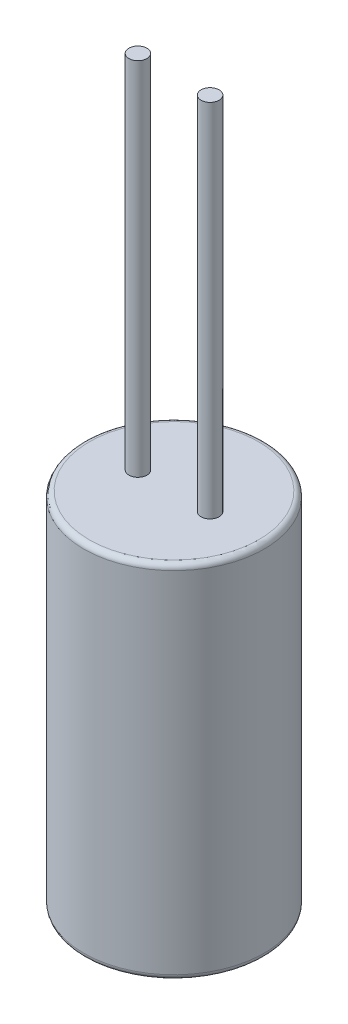
ISO-10303-21;
HEADER;
FILE_DESCRIPTION(('STEP AP214'),'2;1');
FILE_NAME('part.step','',(''),(''),'','','');
FILE_SCHEMA(('AUTOMOTIVE_DESIGN { 1 0 10303 214 1 1 1 1 }'));
ENDSEC;
DATA;
#1=APPLICATION_CONTEXT('core data for automotive mechanical design processes');
#2=APPLICATION_PROTOCOL_DEFINITION('international standard','automotive_design',2000,#1);
#3=PRODUCT_CONTEXT('',#1,'mechanical');
#4=PRODUCT('Part','Part','',(#3));
#5=PRODUCT_RELATED_PRODUCT_CATEGORY('part','',(#4));
#6=PRODUCT_DEFINITION_FORMATION('','',#4);
#7=PRODUCT_DEFINITION_CONTEXT('part definition',#1,'design');
#8=PRODUCT_DEFINITION('design','',#6,#7);
#9=PRODUCT_DEFINITION_SHAPE('','',#8);
#10=(LENGTH_UNIT() NAMED_UNIT(*) SI_UNIT(.MILLI.,.METRE.));
#11=(NAMED_UNIT(*) PLANE_ANGLE_UNIT() SI_UNIT($,.RADIAN.));
#12=(NAMED_UNIT(*) SI_UNIT($,.STERADIAN.) SOLID_ANGLE_UNIT());
#13=UNCERTAINTY_MEASURE_WITH_UNIT(LENGTH_MEASURE(1.E-05),#10,'distance_accuracy_value','');
#14=(GEOMETRIC_REPRESENTATION_CONTEXT(3) GLOBAL_UNCERTAINTY_ASSIGNED_CONTEXT((#13)) GLOBAL_UNIT_ASSIGNED_CONTEXT((#10,
#11,#12)) REPRESENTATION_CONTEXT('',''));
#15=CARTESIAN_POINT('',(0.,0.,0.));
#16=DIRECTION('',(0.,0.,1.));
#17=DIRECTION('',(1.,0.,0.));
#18=AXIS2_PLACEMENT_3D('',#15,#16,#17);
#19=CARTESIAN_POINT('',(0.,20.,0.));
#20=DIRECTION('',(0.,-1.,0.));
#21=DIRECTION('',(0.,0.,-1.));
#22=AXIS2_PLACEMENT_3D('',#19,#20,#21);
#23=CYLINDRICAL_SURFACE('',#22,5.);
#24=CARTESIAN_POINT('',(0.,0.300000000000002,0.));
#25=DIRECTION('',(0.,1.,0.));
#26=DIRECTION('',(0.,0.,1.));
#27=AXIS2_PLACEMENT_3D('',#24,#25,#26);
#28=CIRCLE('',#27,5.);
#29=CARTESIAN_POINT('',(0.,0.300000000000002,5.));
#30=VERTEX_POINT('',#29);
#31=EDGE_CURVE('E44',#30,#30,#28,.T.);
#32=ORIENTED_EDGE('',*,*,#31,.T.);
#33=EDGE_LOOP('',(#32));
#34=FACE_BOUND('',#33,.T.);
#35=CARTESIAN_POINT('',(0.,19.7,0.));
#36=DIRECTION('',(0.,1.,0.));
#37=DIRECTION('',(0.,0.,1.));
#38=AXIS2_PLACEMENT_3D('',#35,#36,#37);
#39=CIRCLE('',#38,5.);
#40=CARTESIAN_POINT('',(0.,19.7,5.));
#41=VERTEX_POINT('',#40);
#42=EDGE_CURVE('E48',#41,#41,#39,.F.);
#43=ORIENTED_EDGE('',*,*,#42,.T.);
#44=EDGE_LOOP('',(#43));
#45=FACE_BOUND('',#44,.T.);
#46=ADVANCED_FACE('F33',(#34,#45),#23,.T.);
#47=CARTESIAN_POINT('',(0.,20.,0.));
#48=DIRECTION('',(0.,1.,0.));
#49=DIRECTION('',(0.,0.,1.));
#50=AXIS2_PLACEMENT_3D('',#47,#48,#49);
#51=PLANE('',#50);
#52=CARTESIAN_POINT('',(0.,20.,0.));
#53=DIRECTION('',(0.,1.,0.));
#54=DIRECTION('',(0.,0.,1.));
#55=AXIS2_PLACEMENT_3D('',#52,#53,#54);
#56=CIRCLE('',#55,4.7);
#57=CARTESIAN_POINT('',(0.,20.,4.7));
#58=VERTEX_POINT('',#57);
#59=EDGE_CURVE('E10',#58,#58,#56,.T.);
#60=ORIENTED_EDGE('',*,*,#59,.T.);
#61=EDGE_LOOP('',(#60));
#62=FACE_BOUND('',#61,.T.);
#63=CARTESIAN_POINT('',(2.,20.,0.));
#64=DIRECTION('',(0.,1.,0.));
#65=DIRECTION('',(0.,0.,1.));
#66=AXIS2_PLACEMENT_3D('',#63,#64,#65);
#67=CIRCLE('',#66,0.5);
#68=CARTESIAN_POINT('',(2.,20.,0.499999999999999));
#69=VERTEX_POINT('',#68);
#70=EDGE_CURVE('E60',#69,#69,#67,.T.);
#71=ORIENTED_EDGE('',*,*,#70,.F.);
#72=EDGE_LOOP('',(#71));
#73=FACE_BOUND('',#72,.T.);
#74=CARTESIAN_POINT('',(-2.,20.,0.));
#75=DIRECTION('',(0.,1.,0.));
#76=DIRECTION('',(0.,0.,1.));
#77=AXIS2_PLACEMENT_3D('',#74,#75,#76);
#78=CIRCLE('',#77,0.5);
#79=CARTESIAN_POINT('',(-2.,20.,0.5));
#80=VERTEX_POINT('',#79);
#81=EDGE_CURVE('E54',#80,#80,#78,.T.);
#82=ORIENTED_EDGE('',*,*,#81,.F.);
#83=EDGE_LOOP('',(#82));
#84=FACE_BOUND('',#83,.T.);
#85=ADVANCED_FACE('F75',(#62,#73,#84),#51,.T.);
#86=CARTESIAN_POINT('',(0.,0.,0.));
#87=DIRECTION('',(0.,1.,0.));
#88=DIRECTION('',(0.,0.,1.));
#89=AXIS2_PLACEMENT_3D('',#86,#87,#88);
#90=PLANE('',#89);
#91=CARTESIAN_POINT('',(0.,0.,0.));
#92=DIRECTION('',(0.,1.,0.));
#93=DIRECTION('',(0.,0.,1.));
#94=AXIS2_PLACEMENT_3D('',#91,#92,#93);
#95=CIRCLE('',#94,4.7);
#96=CARTESIAN_POINT('',(0.,0.,4.7));
#97=VERTEX_POINT('',#96);
#98=EDGE_CURVE('E40',#97,#97,#95,.F.);
#99=ORIENTED_EDGE('',*,*,#98,.T.);
#100=EDGE_LOOP('',(#99));
#101=FACE_BOUND('',#100,.T.);
#102=ADVANCED_FACE('F78',(#101),#90,.F.);
#103=CARTESIAN_POINT('',(-2.,40.,0.));
#104=DIRECTION('',(0.,-1.,0.));
#105=DIRECTION('',(0.,0.,-1.));
#106=AXIS2_PLACEMENT_3D('',#103,#104,#105);
#107=CYLINDRICAL_SURFACE('',#106,0.5);
#108=CARTESIAN_POINT('',(-2.,40.,0.));
#109=DIRECTION('',(0.,1.,0.));
#110=DIRECTION('',(0.,0.,1.));
#111=AXIS2_PLACEMENT_3D('',#108,#109,#110);
#112=CIRCLE('',#111,0.5);
#113=CARTESIAN_POINT('',(-2.,40.,0.5));
#114=VERTEX_POINT('',#113);
#115=EDGE_CURVE('E53',#114,#114,#112,.T.);
#116=ORIENTED_EDGE('',*,*,#115,.F.);
#117=EDGE_LOOP('',(#116));
#118=FACE_BOUND('',#117,.T.);
#119=ORIENTED_EDGE('',*,*,#81,.T.);
#120=EDGE_LOOP('',(#119));
#121=FACE_BOUND('',#120,.T.);
#122=ADVANCED_FACE('F82',(#118,#121),#107,.T.);
#123=CARTESIAN_POINT('',(-2.,40.,0.));
#124=DIRECTION('',(0.,1.,0.));
#125=DIRECTION('',(0.,0.,1.));
#126=AXIS2_PLACEMENT_3D('',#123,#124,#125);
#127=PLANE('',#126);
#128=ORIENTED_EDGE('',*,*,#115,.T.);
#129=EDGE_LOOP('',(#128));
#130=FACE_BOUND('',#129,.T.);
#131=ADVANCED_FACE('F71',(#130),#127,.T.);
#132=CARTESIAN_POINT('',(2.,40.,0.));
#133=DIRECTION('',(0.,-1.,0.));
#134=DIRECTION('',(0.,0.,-1.));
#135=AXIS2_PLACEMENT_3D('',#132,#133,#134);
#136=CYLINDRICAL_SURFACE('',#135,0.5);
#137=CARTESIAN_POINT('',(2.,40.,0.));
#138=DIRECTION('',(0.,1.,0.));
#139=DIRECTION('',(0.,0.,1.));
#140=AXIS2_PLACEMENT_3D('',#137,#138,#139);
#141=CIRCLE('',#140,0.5);
#142=CARTESIAN_POINT('',(2.,40.,0.499999999999999));
#143=VERTEX_POINT('',#142);
#144=EDGE_CURVE('E57',#143,#143,#141,.T.);
#145=ORIENTED_EDGE('',*,*,#144,.F.);
#146=EDGE_LOOP('',(#145));
#147=FACE_BOUND('',#146,.T.);
#148=ORIENTED_EDGE('',*,*,#70,.T.);
#149=EDGE_LOOP('',(#148));
#150=FACE_BOUND('',#149,.T.);
#151=ADVANCED_FACE('F68',(#147,#150),#136,.T.);
#152=CARTESIAN_POINT('',(2.,40.,0.));
#153=DIRECTION('',(0.,1.,0.));
#154=DIRECTION('',(0.,0.,1.));
#155=AXIS2_PLACEMENT_3D('',#152,#153,#154);
#156=PLANE('',#155);
#157=ORIENTED_EDGE('',*,*,#144,.T.);
#158=EDGE_LOOP('',(#157));
#159=FACE_BOUND('',#158,.T.);
#160=ADVANCED_FACE('F66',(#159),#156,.T.);
#161=CARTESIAN_POINT('',(0.,0.300000000000002,0.));
#162=DIRECTION('',(0.,1.,0.));
#163=DIRECTION('',(0.,0.,1.));
#164=AXIS2_PLACEMENT_3D('',#161,#162,#163);
#165=TOROIDAL_SURFACE('',#164,4.7,0.3);
#166=ORIENTED_EDGE('',*,*,#98,.F.);
#167=EDGE_LOOP('',(#166));
#168=FACE_BOUND('',#167,.T.);
#169=ORIENTED_EDGE('',*,*,#31,.F.);
#170=EDGE_LOOP('',(#169));
#171=FACE_BOUND('',#170,.T.);
#172=ADVANCED_FACE('F100',(#168,#171),#165,.T.);
#173=CARTESIAN_POINT('',(0.,19.7,0.));
#174=DIRECTION('',(0.,1.,0.));
#175=DIRECTION('',(0.,0.,1.));
#176=AXIS2_PLACEMENT_3D('',#173,#174,#175);
#177=TOROIDAL_SURFACE('',#176,4.7,0.3);
#178=ORIENTED_EDGE('',*,*,#42,.F.);
#179=EDGE_LOOP('',(#178));
#180=FACE_BOUND('',#179,.T.);
#181=ORIENTED_EDGE('',*,*,#59,.F.);
#182=EDGE_LOOP('',(#181));
#183=FACE_BOUND('',#182,.T.);
#184=ADVANCED_FACE('F35',(#180,#183),#177,.T.);
#185=CLOSED_SHELL('',(#46,#85,#102,#122,#131,#151,#160,#172,#184));
#186=MANIFOLD_SOLID_BREP('B2',#185);
#187=ADVANCED_BREP_SHAPE_REPRESENTATION('',(#18,#186),#14);
#188=SHAPE_DEFINITION_REPRESENTATION(#9,#187);
ENDSEC;
END-ISO-10303-21;
